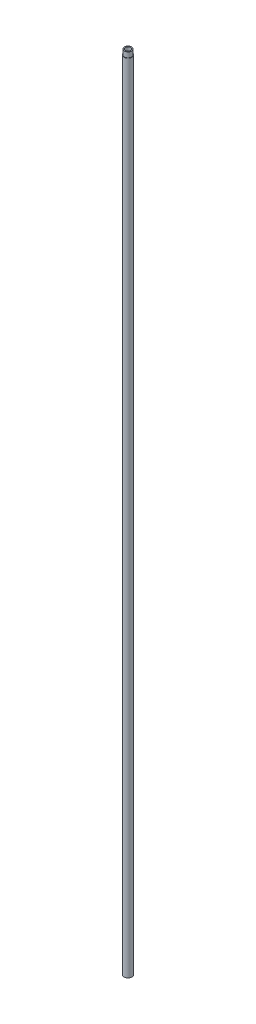
ISO-10303-21;
HEADER;
FILE_DESCRIPTION(('STEP AP214'),'2;1');
FILE_NAME('part.step','',(''),(''),'','','');
FILE_SCHEMA(('AUTOMOTIVE_DESIGN { 1 0 10303 214 1 1 1 1 }'));
ENDSEC;
DATA;
#1=APPLICATION_CONTEXT('core data for automotive mechanical design processes');
#2=APPLICATION_PROTOCOL_DEFINITION('international standard','automotive_design',2000,#1);
#3=PRODUCT_CONTEXT('',#1,'mechanical');
#4=PRODUCT('Part','Part','',(#3));
#5=PRODUCT_RELATED_PRODUCT_CATEGORY('part','',(#4));
#6=PRODUCT_DEFINITION_FORMATION('','',#4);
#7=PRODUCT_DEFINITION_CONTEXT('part definition',#1,'design');
#8=PRODUCT_DEFINITION('design','',#6,#7);
#9=PRODUCT_DEFINITION_SHAPE('','',#8);
#10=(LENGTH_UNIT() NAMED_UNIT(*) SI_UNIT(.MILLI.,.METRE.));
#11=(NAMED_UNIT(*) PLANE_ANGLE_UNIT() SI_UNIT($,.RADIAN.));
#12=(NAMED_UNIT(*) SI_UNIT($,.STERADIAN.) SOLID_ANGLE_UNIT());
#13=UNCERTAINTY_MEASURE_WITH_UNIT(LENGTH_MEASURE(1.E-05),#10,'distance_accuracy_value','');
#14=(GEOMETRIC_REPRESENTATION_CONTEXT(3) GLOBAL_UNCERTAINTY_ASSIGNED_CONTEXT((#13)) GLOBAL_UNIT_ASSIGNED_CONTEXT((#10,
#11,#12)) REPRESENTATION_CONTEXT('',''));
#15=CARTESIAN_POINT('',(0.,0.,0.));
#16=DIRECTION('',(0.,0.,1.));
#17=DIRECTION('',(1.,0.,0.));
#18=AXIS2_PLACEMENT_3D('',#15,#16,#17);
#19=CARTESIAN_POINT('',(0.,37.2593103448276,0.));
#20=DIRECTION('',(0.,1.,0.));
#21=DIRECTION('',(0.,0.,1.));
#22=AXIS2_PLACEMENT_3D('',#19,#20,#21);
#23=CYLINDRICAL_SURFACE('',#22,3.16000000000001);
#24=CARTESIAN_POINT('',(0.,-897.859310344828,0.));
#25=DIRECTION('',(0.,1.,0.));
#26=DIRECTION('',(0.,0.,1.));
#27=AXIS2_PLACEMENT_3D('',#24,#25,#26);
#28=CIRCLE('',#27,3.16000000000001);
#29=CARTESIAN_POINT('',(0.,-897.859310344828,3.16000000000001));
#30=VERTEX_POINT('',#29);
#31=EDGE_CURVE('E58',#30,#30,#28,.T.);
#32=ORIENTED_EDGE('',*,*,#31,.F.);
#33=EDGE_LOOP('',(#32));
#34=FACE_BOUND('',#33,.T.);
#35=CARTESIAN_POINT('',(0.,34.1406896551724,0.));
#36=DIRECTION('',(0.,1.,0.));
#37=DIRECTION('',(0.,0.,1.));
#38=AXIS2_PLACEMENT_3D('',#35,#36,#37);
#39=CIRCLE('',#38,3.16000000000001);
#40=CARTESIAN_POINT('',(0.,34.1406896551724,3.16000000000001));
#41=VERTEX_POINT('',#40);
#42=EDGE_CURVE('E10',#41,#41,#39,.T.);
#43=ORIENTED_EDGE('',*,*,#42,.T.);
#44=EDGE_LOOP('',(#43));
#45=FACE_BOUND('',#44,.T.);
#46=ADVANCED_FACE('F30',(#34,#45),#23,.F.);
#47=CARTESIAN_POINT('',(3.16000000000001,34.1406896551724,0.));
#48=DIRECTION('',(0.,-1.,0.));
#49=DIRECTION('',(0.,0.,-1.));
#50=AXIS2_PLACEMENT_3D('',#47,#48,#49);
#51=PLANE('',#50);
#52=ORIENTED_EDGE('',*,*,#42,.F.);
#53=EDGE_LOOP('',(#52));
#54=FACE_BOUND('',#53,.T.);
#55=CARTESIAN_POINT('',(0.,34.1406896551724,0.));
#56=DIRECTION('',(0.,1.,0.));
#57=DIRECTION('',(0.,0.,1.));
#58=AXIS2_PLACEMENT_3D('',#55,#56,#57);
#59=CIRCLE('',#58,4.26);
#60=CARTESIAN_POINT('',(0.,34.1406896551724,4.26));
#61=VERTEX_POINT('',#60);
#62=EDGE_CURVE('E36',#61,#61,#59,.T.);
#63=ORIENTED_EDGE('',*,*,#62,.T.);
#64=EDGE_LOOP('',(#63));
#65=FACE_BOUND('',#64,.T.);
#66=ADVANCED_FACE('F65',(#54,#65),#51,.F.);
#67=CARTESIAN_POINT('',(0.,37.2593103448276,0.));
#68=DIRECTION('',(0.,1.,0.));
#69=DIRECTION('',(0.,0.,1.));
#70=AXIS2_PLACEMENT_3D('',#67,#68,#69);
#71=CYLINDRICAL_SURFACE('',#70,4.26);
#72=ORIENTED_EDGE('',*,*,#62,.F.);
#73=EDGE_LOOP('',(#72));
#74=FACE_BOUND('',#73,.T.);
#75=CARTESIAN_POINT('',(0.,28.1406896551724,0.));
#76=DIRECTION('',(0.,1.,0.));
#77=DIRECTION('',(0.,0.,1.));
#78=AXIS2_PLACEMENT_3D('',#75,#76,#77);
#79=CIRCLE('',#78,4.26);
#80=CARTESIAN_POINT('',(0.,28.1406896551724,4.26));
#81=VERTEX_POINT('',#80);
#82=EDGE_CURVE('E40',#81,#81,#79,.T.);
#83=ORIENTED_EDGE('',*,*,#82,.T.);
#84=EDGE_LOOP('',(#83));
#85=FACE_BOUND('',#84,.T.);
#86=ADVANCED_FACE('F69',(#74,#85),#71,.T.);
#87=CARTESIAN_POINT('',(4.26,28.1406896551724,0.));
#88=DIRECTION('',(0.,-1.,0.));
#89=DIRECTION('',(0.,0.,-1.));
#90=AXIS2_PLACEMENT_3D('',#87,#88,#89);
#91=PLANE('',#90);
#92=ORIENTED_EDGE('',*,*,#82,.F.);
#93=EDGE_LOOP('',(#92));
#94=FACE_BOUND('',#93,.T.);
#95=CARTESIAN_POINT('',(0.,28.1406896551724,0.));
#96=DIRECTION('',(0.,1.,0.));
#97=DIRECTION('',(0.,0.,1.));
#98=AXIS2_PLACEMENT_3D('',#95,#96,#97);
#99=CIRCLE('',#98,4.76);
#100=CARTESIAN_POINT('',(0.,28.1406896551724,4.76));
#101=VERTEX_POINT('',#100);
#102=EDGE_CURVE('E44',#101,#101,#99,.T.);
#103=ORIENTED_EDGE('',*,*,#102,.T.);
#104=EDGE_LOOP('',(#103));
#105=FACE_BOUND('',#104,.T.);
#106=ADVANCED_FACE('F74',(#94,#105),#91,.F.);
#107=CARTESIAN_POINT('',(0.,37.2593103448276,0.));
#108=DIRECTION('',(0.,1.,0.));
#109=DIRECTION('',(0.,0.,1.));
#110=AXIS2_PLACEMENT_3D('',#107,#108,#109);
#111=CYLINDRICAL_SURFACE('',#110,4.76000000000006);
#112=ORIENTED_EDGE('',*,*,#102,.F.);
#113=EDGE_LOOP('',(#112));
#114=FACE_BOUND('',#113,.T.);
#115=CARTESIAN_POINT('',(0.,-905.859310344828,0.));
#116=DIRECTION('',(0.,1.,0.));
#117=DIRECTION('',(0.,0.,1.));
#118=AXIS2_PLACEMENT_3D('',#115,#116,#117);
#119=CIRCLE('',#118,4.76000000000012);
#120=CARTESIAN_POINT('',(0.,-905.859310344828,4.76000000000012));
#121=VERTEX_POINT('',#120);
#122=EDGE_CURVE('E49',#121,#121,#119,.T.);
#123=ORIENTED_EDGE('',*,*,#122,.T.);
#124=EDGE_LOOP('',(#123));
#125=FACE_BOUND('',#124,.T.);
#126=ADVANCED_FACE('F80',(#114,#125),#111,.T.);
#127=CARTESIAN_POINT('',(4.76000000000012,-905.859310344828,0.));
#128=DIRECTION('',(0.,1.,0.));
#129=DIRECTION('',(0.,0.,1.));
#130=AXIS2_PLACEMENT_3D('',#127,#128,#129);
#131=PLANE('',#130);
#132=ORIENTED_EDGE('',*,*,#122,.F.);
#133=EDGE_LOOP('',(#132));
#134=FACE_BOUND('',#133,.T.);
#135=CARTESIAN_POINT('',(0.,-905.859310344828,0.));
#136=DIRECTION('',(0.,1.,0.));
#137=DIRECTION('',(0.,0.,1.));
#138=AXIS2_PLACEMENT_3D('',#135,#136,#137);
#139=CIRCLE('',#138,3.76000000000011);
#140=CARTESIAN_POINT('',(0.,-905.859310344828,3.76000000000011));
#141=VERTEX_POINT('',#140);
#142=EDGE_CURVE('E52',#141,#141,#139,.T.);
#143=ORIENTED_EDGE('',*,*,#142,.T.);
#144=EDGE_LOOP('',(#143));
#145=FACE_BOUND('',#144,.T.);
#146=ADVANCED_FACE('F84',(#134,#145),#131,.F.);
#147=CARTESIAN_POINT('',(0.,37.2593103448276,0.));
#148=DIRECTION('',(0.,1.,0.));
#149=DIRECTION('',(0.,0.,1.));
#150=AXIS2_PLACEMENT_3D('',#147,#148,#149);
#151=CYLINDRICAL_SURFACE('',#150,3.76000000000011);
#152=ORIENTED_EDGE('',*,*,#142,.F.);
#153=EDGE_LOOP('',(#152));
#154=FACE_BOUND('',#153,.T.);
#155=CARTESIAN_POINT('',(0.,-897.859310344828,0.));
#156=DIRECTION('',(0.,1.,0.));
#157=DIRECTION('',(0.,0.,1.));
#158=AXIS2_PLACEMENT_3D('',#155,#156,#157);
#159=CIRCLE('',#158,3.76000000000011);
#160=CARTESIAN_POINT('',(0.,-897.859310344828,3.76000000000011));
#161=VERTEX_POINT('',#160);
#162=EDGE_CURVE('E55',#161,#161,#159,.T.);
#163=ORIENTED_EDGE('',*,*,#162,.T.);
#164=EDGE_LOOP('',(#163));
#165=FACE_BOUND('',#164,.T.);
#166=ADVANCED_FACE('F88',(#154,#165),#151,.F.);
#167=CARTESIAN_POINT('',(3.76000000000011,-897.859310344828,0.));
#168=DIRECTION('',(0.,1.,0.));
#169=DIRECTION('',(0.,0.,1.));
#170=AXIS2_PLACEMENT_3D('',#167,#168,#169);
#171=PLANE('',#170);
#172=ORIENTED_EDGE('',*,*,#162,.F.);
#173=EDGE_LOOP('',(#172));
#174=FACE_BOUND('',#173,.T.);
#175=ORIENTED_EDGE('',*,*,#31,.T.);
#176=EDGE_LOOP('',(#175));
#177=FACE_BOUND('',#176,.T.);
#178=ADVANCED_FACE('F62',(#174,#177),#171,.F.);
#179=CLOSED_SHELL('',(#46,#66,#86,#106,#126,#146,#166,#178));
#180=MANIFOLD_SOLID_BREP('B2',#179);
#181=ADVANCED_BREP_SHAPE_REPRESENTATION('',(#18,#180),#14);
#182=SHAPE_DEFINITION_REPRESENTATION(#9,#181);
ENDSEC;
END-ISO-10303-21;
